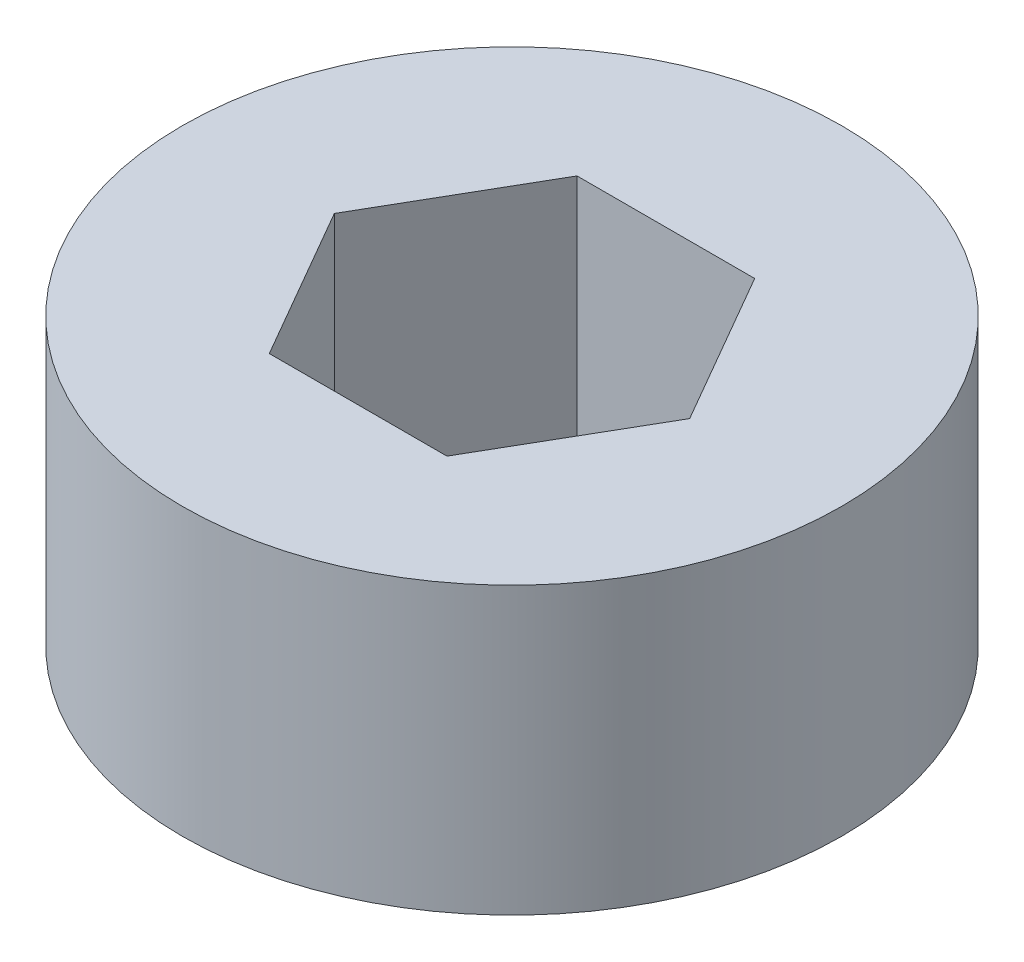
ISO-10303-21;
HEADER;
FILE_DESCRIPTION(('STEP AP214'),'2;1');
FILE_NAME('part.step','',(''),(''),'','','');
FILE_SCHEMA(('AUTOMOTIVE_DESIGN { 1 0 10303 214 1 1 1 1 }'));
ENDSEC;
DATA;
#1=APPLICATION_CONTEXT('core data for automotive mechanical design processes');
#2=APPLICATION_PROTOCOL_DEFINITION('international standard','automotive_design',2000,#1);
#3=PRODUCT_CONTEXT('',#1,'mechanical');
#4=PRODUCT('Part','Part','',(#3));
#5=PRODUCT_RELATED_PRODUCT_CATEGORY('part','',(#4));
#6=PRODUCT_DEFINITION_FORMATION('','',#4);
#7=PRODUCT_DEFINITION_CONTEXT('part definition',#1,'design');
#8=PRODUCT_DEFINITION('design','',#6,#7);
#9=PRODUCT_DEFINITION_SHAPE('','',#8);
#10=(LENGTH_UNIT() NAMED_UNIT(*) SI_UNIT(.MILLI.,.METRE.));
#11=(NAMED_UNIT(*) PLANE_ANGLE_UNIT() SI_UNIT($,.RADIAN.));
#12=(NAMED_UNIT(*) SI_UNIT($,.STERADIAN.) SOLID_ANGLE_UNIT());
#13=UNCERTAINTY_MEASURE_WITH_UNIT(LENGTH_MEASURE(1.E-05),#10,'distance_accuracy_value','');
#14=(GEOMETRIC_REPRESENTATION_CONTEXT(3) GLOBAL_UNCERTAINTY_ASSIGNED_CONTEXT((#13)) GLOBAL_UNIT_ASSIGNED_CONTEXT((#10,
#11,#12)) REPRESENTATION_CONTEXT('',''));
#15=CARTESIAN_POINT('',(0.,0.,0.));
#16=DIRECTION('',(0.,0.,1.));
#17=DIRECTION('',(1.,0.,0.));
#18=AXIS2_PLACEMENT_3D('',#15,#16,#17);
#19=CARTESIAN_POINT('',(0.,13.,0.));
#20=DIRECTION('',(0.,1.,0.));
#21=DIRECTION('',(0.,0.,1.));
#22=AXIS2_PLACEMENT_3D('',#19,#20,#21);
#23=PLANE('',#22);
#24=CARTESIAN_POINT('',(0.,13.,0.));
#25=DIRECTION('',(0.,1.,0.));
#26=DIRECTION('',(0.,0.,1.));
#27=AXIS2_PLACEMENT_3D('',#24,#25,#26);
#28=CIRCLE('',#27,15.);
#29=CARTESIAN_POINT('',(0.,13.,15.));
#30=VERTEX_POINT('',#29);
#31=EDGE_CURVE('E96',#30,#30,#28,.T.);
#32=ORIENTED_EDGE('',*,*,#31,.T.);
#33=EDGE_LOOP('',(#32));
#34=FACE_BOUND('',#33,.T.);
#35=DIRECTION('',(0.5,0.,0.866025403784439));
#36=VECTOR('',#35,1.);
#37=CARTESIAN_POINT('',(6.06217782649107,13.,-3.5));
#38=LINE('',#37,#36);
#39=CARTESIAN_POINT('',(4.04145188432738,13.,-7.));
#40=VERTEX_POINT('',#39);
#41=CARTESIAN_POINT('',(8.08290376865476,13.,0.));
#42=VERTEX_POINT('',#41);
#43=EDGE_CURVE('E144',#40,#42,#38,.T.);
#44=ORIENTED_EDGE('',*,*,#43,.T.);
#45=DIRECTION('',(-0.5,0.,0.866025403784439));
#46=VECTOR('',#45,1.);
#47=CARTESIAN_POINT('',(6.06217782649107,13.,3.5));
#48=LINE('',#47,#46);
#49=CARTESIAN_POINT('',(4.04145188432738,13.,7.));
#50=VERTEX_POINT('',#49);
#51=EDGE_CURVE('E129',#42,#50,#48,.T.);
#52=ORIENTED_EDGE('',*,*,#51,.T.);
#53=DIRECTION('',(-1.,0.,0.));
#54=VECTOR('',#53,1.);
#55=CARTESIAN_POINT('',(0.,13.,7.));
#56=LINE('',#55,#54);
#57=CARTESIAN_POINT('',(-4.04145188432738,13.,7.));
#58=VERTEX_POINT('',#57);
#59=EDGE_CURVE('E130',#50,#58,#56,.T.);
#60=ORIENTED_EDGE('',*,*,#59,.T.);
#61=DIRECTION('',(-0.5,0.,-0.866025403784439));
#62=VECTOR('',#61,1.);
#63=CARTESIAN_POINT('',(-6.06217782649108,13.,3.5));
#64=LINE('',#63,#62);
#65=CARTESIAN_POINT('',(-8.08290376865477,13.,0.));
#66=VERTEX_POINT('',#65);
#67=EDGE_CURVE('E103',#58,#66,#64,.T.);
#68=ORIENTED_EDGE('',*,*,#67,.T.);
#69=DIRECTION('',(0.5,0.,-0.866025403784439));
#70=VECTOR('',#69,1.);
#71=CARTESIAN_POINT('',(-6.06217782649107,13.,-3.5));
#72=LINE('',#71,#70);
#73=CARTESIAN_POINT('',(-4.04145188432738,13.,-7.));
#74=VERTEX_POINT('',#73);
#75=EDGE_CURVE('E138',#66,#74,#72,.T.);
#76=ORIENTED_EDGE('',*,*,#75,.T.);
#77=DIRECTION('',(1.,0.,0.));
#78=VECTOR('',#77,1.);
#79=CARTESIAN_POINT('',(0.,13.,-7.));
#80=LINE('',#79,#78);
#81=EDGE_CURVE('E141',#74,#40,#80,.T.);
#82=ORIENTED_EDGE('',*,*,#81,.T.);
#83=EDGE_LOOP('',(#44,#52,#60,#68,#76,#82));
#84=FACE_BOUND('',#83,.T.);
#85=ADVANCED_FACE('F41',(#34,#84),#23,.T.);
#86=CARTESIAN_POINT('',(0.,0.,0.));
#87=DIRECTION('',(0.,1.,0.));
#88=DIRECTION('',(0.,0.,1.));
#89=AXIS2_PLACEMENT_3D('',#86,#87,#88);
#90=PLANE('',#89);
#91=CARTESIAN_POINT('',(0.,0.,0.));
#92=DIRECTION('',(0.,1.,0.));
#93=DIRECTION('',(0.,0.,1.));
#94=AXIS2_PLACEMENT_3D('',#91,#92,#93);
#95=CIRCLE('',#94,15.);
#96=CARTESIAN_POINT('',(0.,0.,15.));
#97=VERTEX_POINT('',#96);
#98=EDGE_CURVE('E147',#97,#97,#95,.T.);
#99=ORIENTED_EDGE('',*,*,#98,.F.);
#100=EDGE_LOOP('',(#99));
#101=FACE_BOUND('',#100,.T.);
#102=DIRECTION('',(-0.5,0.,0.866025403784439));
#103=VECTOR('',#102,1.);
#104=CARTESIAN_POINT('',(6.06217782649107,0.,3.5));
#105=LINE('',#104,#103);
#106=CARTESIAN_POINT('',(8.08290376865476,0.,0.));
#107=VERTEX_POINT('',#106);
#108=CARTESIAN_POINT('',(4.04145188432738,0.,7.));
#109=VERTEX_POINT('',#108);
#110=EDGE_CURVE('E11',#107,#109,#105,.T.);
#111=ORIENTED_EDGE('',*,*,#110,.F.);
#112=DIRECTION('',(0.5,0.,0.866025403784439));
#113=VECTOR('',#112,1.);
#114=CARTESIAN_POINT('',(6.06217782649107,0.,-3.5));
#115=LINE('',#114,#113);
#116=CARTESIAN_POINT('',(4.04145188432738,0.,-7.));
#117=VERTEX_POINT('',#116);
#118=EDGE_CURVE('E49',#117,#107,#115,.T.);
#119=ORIENTED_EDGE('',*,*,#118,.F.);
#120=DIRECTION('',(1.,0.,0.));
#121=VECTOR('',#120,1.);
#122=CARTESIAN_POINT('',(0.,0.,-7.));
#123=LINE('',#122,#121);
#124=CARTESIAN_POINT('',(-4.04145188432738,0.,-7.));
#125=VERTEX_POINT('',#124);
#126=EDGE_CURVE('E112',#125,#117,#123,.T.);
#127=ORIENTED_EDGE('',*,*,#126,.F.);
#128=DIRECTION('',(0.5,0.,-0.866025403784439));
#129=VECTOR('',#128,1.);
#130=CARTESIAN_POINT('',(-6.06217782649107,0.,-3.5));
#131=LINE('',#130,#129);
#132=CARTESIAN_POINT('',(-8.08290376865477,0.,0.));
#133=VERTEX_POINT('',#132);
#134=EDGE_CURVE('E110',#133,#125,#131,.T.);
#135=ORIENTED_EDGE('',*,*,#134,.F.);
#136=DIRECTION('',(-0.5,0.,-0.866025403784439));
#137=VECTOR('',#136,1.);
#138=CARTESIAN_POINT('',(-6.06217782649108,0.,3.5));
#139=LINE('',#138,#137);
#140=CARTESIAN_POINT('',(-4.04145188432738,0.,7.));
#141=VERTEX_POINT('',#140);
#142=EDGE_CURVE('E95',#141,#133,#139,.T.);
#143=ORIENTED_EDGE('',*,*,#142,.F.);
#144=DIRECTION('',(-1.,0.,0.));
#145=VECTOR('',#144,1.);
#146=CARTESIAN_POINT('',(0.,0.,7.));
#147=LINE('',#146,#145);
#148=EDGE_CURVE('E90',#109,#141,#147,.T.);
#149=ORIENTED_EDGE('',*,*,#148,.F.);
#150=EDGE_LOOP('',(#111,#119,#127,#135,#143,#149));
#151=FACE_BOUND('',#150,.T.);
#152=ADVANCED_FACE('F108',(#101,#151),#90,.F.);
#153=CARTESIAN_POINT('',(0.,13.,0.));
#154=DIRECTION('',(0.,-1.,0.));
#155=DIRECTION('',(0.,0.,-1.));
#156=AXIS2_PLACEMENT_3D('',#153,#154,#155);
#157=CYLINDRICAL_SURFACE('',#156,15.);
#158=ORIENTED_EDGE('',*,*,#31,.F.);
#159=EDGE_LOOP('',(#158));
#160=FACE_BOUND('',#159,.T.);
#161=ORIENTED_EDGE('',*,*,#98,.T.);
#162=EDGE_LOOP('',(#161));
#163=FACE_BOUND('',#162,.T.);
#164=ADVANCED_FACE('F43',(#160,#163),#157,.T.);
#165=CARTESIAN_POINT('',(4.04145188432738,39.,7.));
#166=DIRECTION('',(-0.866025403784439,0.,-0.5));
#167=DIRECTION('',(-0.5,0.,0.866025403784439));
#168=AXIS2_PLACEMENT_3D('',#165,#166,#167);
#169=PLANE('',#168);
#170=DIRECTION('',(0.,-1.,0.));
#171=VECTOR('',#170,1.);
#172=CARTESIAN_POINT('',(8.08290376865476,39.,0.));
#173=LINE('',#172,#171);
#174=EDGE_CURVE('E122',#42,#107,#173,.T.);
#175=ORIENTED_EDGE('',*,*,#174,.T.);
#176=ORIENTED_EDGE('',*,*,#110,.T.);
#177=DIRECTION('',(0.,-1.,0.));
#178=VECTOR('',#177,1.);
#179=CARTESIAN_POINT('',(4.04145188432738,39.,7.));
#180=LINE('',#179,#178);
#181=EDGE_CURVE('E61',#50,#109,#180,.T.);
#182=ORIENTED_EDGE('',*,*,#181,.F.);
#183=ORIENTED_EDGE('',*,*,#51,.F.);
#184=EDGE_LOOP('',(#175,#176,#182,#183));
#185=FACE_BOUND('',#184,.T.);
#186=ADVANCED_FACE('F127',(#185),#169,.T.);
#187=CARTESIAN_POINT('',(8.08290376865476,39.,0.));
#188=DIRECTION('',(-0.866025403784439,0.,0.5));
#189=DIRECTION('',(0.5,0.,0.866025403784439));
#190=AXIS2_PLACEMENT_3D('',#187,#188,#189);
#191=PLANE('',#190);
#192=DIRECTION('',(0.,-1.,0.));
#193=VECTOR('',#192,1.);
#194=CARTESIAN_POINT('',(4.04145188432738,39.,-7.));
#195=LINE('',#194,#193);
#196=EDGE_CURVE('E125',#40,#117,#195,.T.);
#197=ORIENTED_EDGE('',*,*,#196,.T.);
#198=ORIENTED_EDGE('',*,*,#118,.T.);
#199=ORIENTED_EDGE('',*,*,#174,.F.);
#200=ORIENTED_EDGE('',*,*,#43,.F.);
#201=EDGE_LOOP('',(#197,#198,#199,#200));
#202=FACE_BOUND('',#201,.T.);
#203=ADVANCED_FACE('F121',(#202),#191,.T.);
#204=CARTESIAN_POINT('',(4.04145188432738,39.,-7.));
#205=DIRECTION('',(0.,0.,1.));
#206=DIRECTION('',(1.,0.,0.));
#207=AXIS2_PLACEMENT_3D('',#204,#205,#206);
#208=PLANE('',#207);
#209=DIRECTION('',(0.,-1.,0.));
#210=VECTOR('',#209,1.);
#211=CARTESIAN_POINT('',(-4.04145188432738,39.,-7.));
#212=LINE('',#211,#210);
#213=EDGE_CURVE('E133',#74,#125,#212,.T.);
#214=ORIENTED_EDGE('',*,*,#213,.T.);
#215=ORIENTED_EDGE('',*,*,#126,.T.);
#216=ORIENTED_EDGE('',*,*,#196,.F.);
#217=ORIENTED_EDGE('',*,*,#81,.F.);
#218=EDGE_LOOP('',(#214,#215,#216,#217));
#219=FACE_BOUND('',#218,.T.);
#220=ADVANCED_FACE('F166',(#219),#208,.T.);
#221=CARTESIAN_POINT('',(-4.04145188432738,39.,-7.));
#222=DIRECTION('',(0.866025403784439,0.,0.5));
#223=DIRECTION('',(0.5,0.,-0.866025403784439));
#224=AXIS2_PLACEMENT_3D('',#221,#222,#223);
#225=PLANE('',#224);
#226=DIRECTION('',(0.,-1.,0.));
#227=VECTOR('',#226,1.);
#228=CARTESIAN_POINT('',(-8.08290376865477,39.,0.));
#229=LINE('',#228,#227);
#230=EDGE_CURVE('E105',#66,#133,#229,.T.);
#231=ORIENTED_EDGE('',*,*,#230,.T.);
#232=ORIENTED_EDGE('',*,*,#134,.T.);
#233=ORIENTED_EDGE('',*,*,#213,.F.);
#234=ORIENTED_EDGE('',*,*,#75,.F.);
#235=EDGE_LOOP('',(#231,#232,#233,#234));
#236=FACE_BOUND('',#235,.T.);
#237=ADVANCED_FACE('F169',(#236),#225,.T.);
#238=CARTESIAN_POINT('',(-8.08290376865477,39.,0.));
#239=DIRECTION('',(0.866025403784439,0.,-0.5));
#240=DIRECTION('',(-0.5,0.,-0.866025403784439));
#241=AXIS2_PLACEMENT_3D('',#238,#239,#240);
#242=PLANE('',#241);
#243=DIRECTION('',(0.,-1.,0.));
#244=VECTOR('',#243,1.);
#245=CARTESIAN_POINT('',(-4.04145188432738,39.,7.));
#246=LINE('',#245,#244);
#247=EDGE_CURVE('E56',#58,#141,#246,.T.);
#248=ORIENTED_EDGE('',*,*,#247,.T.);
#249=ORIENTED_EDGE('',*,*,#142,.T.);
#250=ORIENTED_EDGE('',*,*,#230,.F.);
#251=ORIENTED_EDGE('',*,*,#67,.F.);
#252=EDGE_LOOP('',(#248,#249,#250,#251));
#253=FACE_BOUND('',#252,.T.);
#254=ADVANCED_FACE('F99',(#253),#242,.T.);
#255=CARTESIAN_POINT('',(-4.04145188432738,39.,7.));
#256=DIRECTION('',(0.,0.,-1.));
#257=DIRECTION('',(-1.,0.,0.));
#258=AXIS2_PLACEMENT_3D('',#255,#256,#257);
#259=PLANE('',#258);
#260=ORIENTED_EDGE('',*,*,#181,.T.);
#261=ORIENTED_EDGE('',*,*,#148,.T.);
#262=ORIENTED_EDGE('',*,*,#247,.F.);
#263=ORIENTED_EDGE('',*,*,#59,.F.);
#264=EDGE_LOOP('',(#260,#261,#262,#263));
#265=FACE_BOUND('',#264,.T.);
#266=ADVANCED_FACE('F91',(#265),#259,.T.);
#267=CLOSED_SHELL('',(#85,#152,#164,#186,#203,#220,#237,#254,#266));
#268=MANIFOLD_SOLID_BREP('B2',#267);
#269=ADVANCED_BREP_SHAPE_REPRESENTATION('',(#18,#268),#14);
#270=SHAPE_DEFINITION_REPRESENTATION(#9,#269);
ENDSEC;
END-ISO-10303-21;
